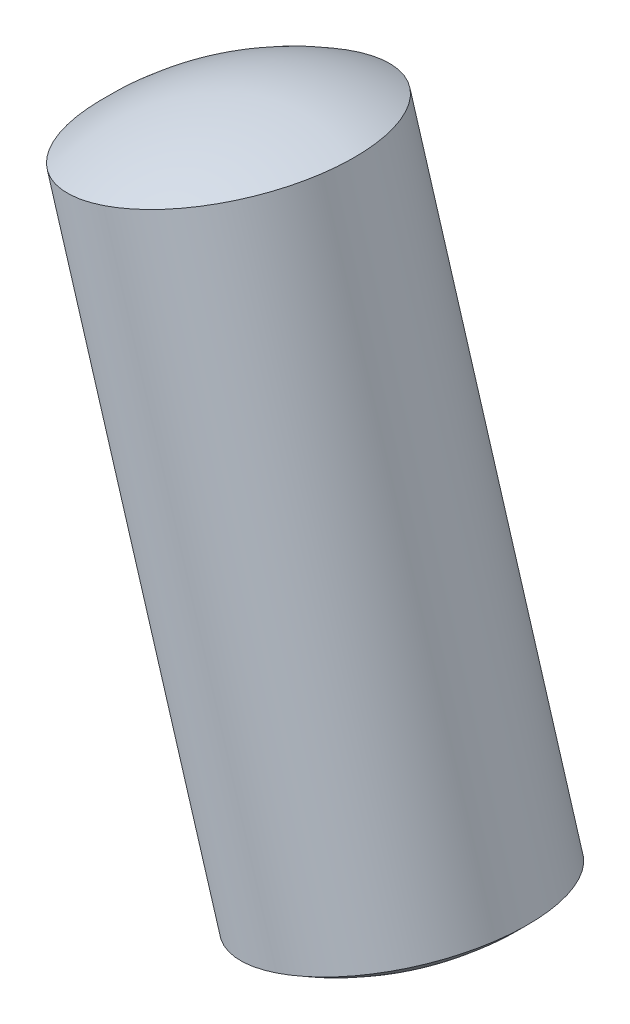
ISO-10303-21;
HEADER;
FILE_DESCRIPTION(('STEP AP214'),'2;1');
FILE_NAME('part.step','',(''),(''),'','','');
FILE_SCHEMA(('AUTOMOTIVE_DESIGN { 1 0 10303 214 1 1 1 1 }'));
ENDSEC;
DATA;
#1=APPLICATION_CONTEXT('core data for automotive mechanical design processes');
#2=APPLICATION_PROTOCOL_DEFINITION('international standard','automotive_design',2000,#1);
#3=PRODUCT_CONTEXT('',#1,'mechanical');
#4=PRODUCT('Part','Part','',(#3));
#5=PRODUCT_RELATED_PRODUCT_CATEGORY('part','',(#4));
#6=PRODUCT_DEFINITION_FORMATION('','',#4);
#7=PRODUCT_DEFINITION_CONTEXT('part definition',#1,'design');
#8=PRODUCT_DEFINITION('design','',#6,#7);
#9=PRODUCT_DEFINITION_SHAPE('','',#8);
#10=(LENGTH_UNIT() NAMED_UNIT(*) SI_UNIT(.MILLI.,.METRE.));
#11=(NAMED_UNIT(*) PLANE_ANGLE_UNIT() SI_UNIT($,.RADIAN.));
#12=(NAMED_UNIT(*) SI_UNIT($,.STERADIAN.) SOLID_ANGLE_UNIT());
#13=UNCERTAINTY_MEASURE_WITH_UNIT(LENGTH_MEASURE(1.E-05),#10,'distance_accuracy_value','');
#14=(GEOMETRIC_REPRESENTATION_CONTEXT(3) GLOBAL_UNCERTAINTY_ASSIGNED_CONTEXT((#13)) GLOBAL_UNIT_ASSIGNED_CONTEXT((#10,
#11,#12)) REPRESENTATION_CONTEXT('',''));
#15=CARTESIAN_POINT('',(0.,0.,0.));
#16=DIRECTION('',(0.,0.,1.));
#17=DIRECTION('',(1.,0.,0.));
#18=AXIS2_PLACEMENT_3D('',#15,#16,#17);
#19=CARTESIAN_POINT('',(-6.40226620448384,21.3747207960931,0.6));
#20=DIRECTION('',(0.957951394580497,0.286930524032006,0.));
#21=DIRECTION('',(-0.286930524032006,0.957951394580497,0.));
#22=AXIS2_PLACEMENT_3D('',#19,#20,#21);
#23=SPHERICAL_SURFACE('',#22,2.);
#24=CARTESIAN_POINT('',(-6.40226620448384,21.3747207960931,0.6));
#25=DIRECTION('',(0.286930524032006,-0.957951394580497,0.));
#26=DIRECTION('',(0.,0.,-1.));
#27=AXIS2_PLACEMENT_3D('',#24,#25,#26);
#28=SPHERICAL_SURFACE('',#27,2.);
#29=CARTESIAN_POINT('',(-6.89924445034955,23.033941282688,0.599999999999989));
#30=DIRECTION('',(0.286930524032006,-0.957951394580497,0.));
#31=DIRECTION('',(0.,0.,-1.));
#32=AXIS2_PLACEMENT_3D('',#29,#30,#31);
#33=CIRCLE('',#32,1.);
#34=CARTESIAN_POINT('',(-6.89924445034955,23.033941282688,-0.400000000000011));
#35=VERTEX_POINT('',#34);
#36=EDGE_CURVE('E11',#35,#35,#33,.T.);
#37=ORIENTED_EDGE('',*,*,#36,.F.);
#38=EDGE_LOOP('',(#37));
#39=FACE_BOUND('',#38,.T.);
#40=ADVANCED_FACE('F17',(#39),#28,.T.);
#41=CARTESIAN_POINT('',(-6.0792115909085,20.2961648681584,0.6));
#42=DIRECTION('',(0.957951394580497,0.286930524032006,0.));
#43=DIRECTION('',(0.286930524032006,-0.957951394580497,0.));
#44=AXIS2_PLACEMENT_3D('',#41,#42,#43);
#45=SPHERICAL_SURFACE('',#44,2.);
#46=CARTESIAN_POINT('',(-6.0792115909085,20.2961648681584,0.6));
#47=DIRECTION('',(0.286930524032006,-0.957951394580497,0.));
#48=DIRECTION('',(0.,0.,-1.));
#49=AXIS2_PLACEMENT_3D('',#46,#47,#48);
#50=SPHERICAL_SURFACE('',#49,2.);
#51=CARTESIAN_POINT('',(-5.58223334504268,18.6369443815636,0.6));
#52=DIRECTION('',(0.286930524032006,-0.957951394580497,0.));
#53=DIRECTION('',(0.,0.,-1.));
#54=AXIS2_PLACEMENT_3D('',#51,#52,#53);
#55=CIRCLE('',#54,1.);
#56=CARTESIAN_POINT('',(-5.58223334504268,18.6369443815636,-0.4));
#57=VERTEX_POINT('',#56);
#58=EDGE_CURVE('E26',#57,#57,#55,.T.);
#59=ORIENTED_EDGE('',*,*,#58,.T.);
#60=EDGE_LOOP('',(#59));
#61=FACE_BOUND('',#60,.T.);
#62=ADVANCED_FACE('F40',(#61),#50,.T.);
#63=CARTESIAN_POINT('',(-5.9114861213694,19.7361936068447,0.6));
#64=DIRECTION('',(0.286930524032006,-0.957951394580497,0.));
#65=DIRECTION('',(0.,0.,-1.));
#66=AXIS2_PLACEMENT_3D('',#63,#64,#65);
#67=CYLINDRICAL_SURFACE('',#66,1.);
#68=ORIENTED_EDGE('',*,*,#36,.T.);
#69=EDGE_LOOP('',(#68));
#70=FACE_BOUND('',#69,.T.);
#71=ORIENTED_EDGE('',*,*,#58,.F.);
#72=EDGE_LOOP('',(#71));
#73=FACE_BOUND('',#72,.T.);
#74=ADVANCED_FACE('F19',(#70,#73),#67,.T.);
#75=CLOSED_SHELL('',(#40,#62,#74));
#76=MANIFOLD_SOLID_BREP('B1',#75);
#77=ADVANCED_BREP_SHAPE_REPRESENTATION('',(#18,#76),#14);
#78=SHAPE_DEFINITION_REPRESENTATION(#9,#77);
ENDSEC;
END-ISO-10303-21;
